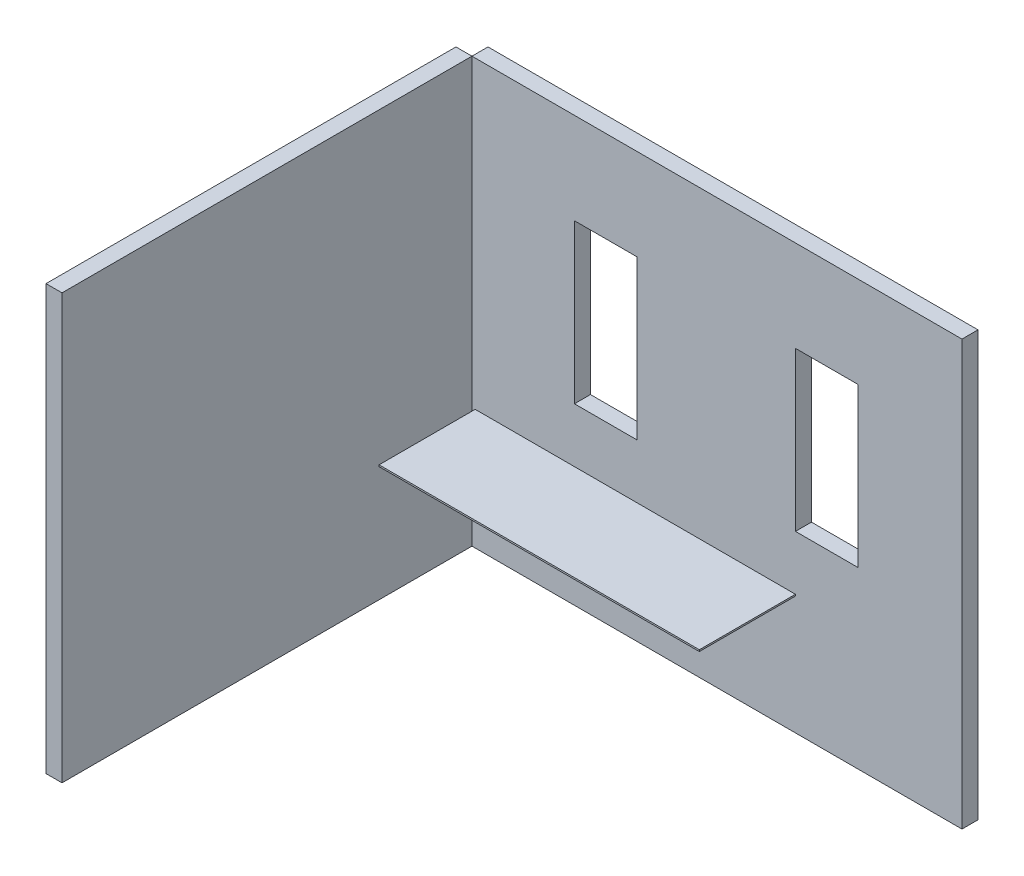
ISO-10303-21;
HEADER;
FILE_DESCRIPTION(('STEP AP214'),'2;1');
FILE_NAME('part.step','',(''),(''),'','','');
FILE_SCHEMA(('AUTOMOTIVE_DESIGN { 1 0 10303 214 1 1 1 1 }'));
ENDSEC;
DATA;
#1=APPLICATION_CONTEXT('core data for automotive mechanical design processes');
#2=APPLICATION_PROTOCOL_DEFINITION('international standard','automotive_design',2000,#1);
#3=PRODUCT_CONTEXT('',#1,'mechanical');
#4=PRODUCT('Part','Part','',(#3));
#5=PRODUCT_RELATED_PRODUCT_CATEGORY('part','',(#4));
#6=PRODUCT_DEFINITION_FORMATION('','',#4);
#7=PRODUCT_DEFINITION_CONTEXT('part definition',#1,'design');
#8=PRODUCT_DEFINITION('design','',#6,#7);
#9=PRODUCT_DEFINITION_SHAPE('','',#8);
#10=(LENGTH_UNIT() NAMED_UNIT(*) SI_UNIT(.MILLI.,.METRE.));
#11=(NAMED_UNIT(*) PLANE_ANGLE_UNIT() SI_UNIT($,.RADIAN.));
#12=(NAMED_UNIT(*) SI_UNIT($,.STERADIAN.) SOLID_ANGLE_UNIT());
#13=UNCERTAINTY_MEASURE_WITH_UNIT(LENGTH_MEASURE(1.E-05),#10,'distance_accuracy_value','');
#14=(GEOMETRIC_REPRESENTATION_CONTEXT(3) GLOBAL_UNCERTAINTY_ASSIGNED_CONTEXT((#13)) GLOBAL_UNIT_ASSIGNED_CONTEXT((#10,
#11,#12)) REPRESENTATION_CONTEXT('',''));
#15=CARTESIAN_POINT('',(0.,0.,0.));
#16=DIRECTION('',(0.,0.,1.));
#17=DIRECTION('',(1.,0.,0.));
#18=AXIS2_PLACEMENT_3D('',#15,#16,#17);
#19=CARTESIAN_POINT('',(0.,2650.,2660.));
#20=DIRECTION('',(-1.,0.,0.));
#21=DIRECTION('',(0.,0.,1.));
#22=AXIS2_PLACEMENT_3D('',#19,#20,#21);
#23=PLANE('',#22);
#24=DIRECTION('',(0.,1.,0.));
#25=VECTOR('',#24,1.);
#26=CARTESIAN_POINT('',(0.,2650.,100.));
#27=LINE('',#26,#25);
#28=CARTESIAN_POINT('',(0.,0.,100.));
#29=VERTEX_POINT('',#28);
#30=CARTESIAN_POINT('',(0.,2650.,100.));
#31=VERTEX_POINT('',#30);
#32=EDGE_CURVE('E108',#29,#31,#27,.T.);
#33=ORIENTED_EDGE('',*,*,#32,.T.);
#34=DIRECTION('',(0.,0.,-1.));
#35=VECTOR('',#34,1.);
#36=CARTESIAN_POINT('',(0.,2650.,2660.));
#37=LINE('',#36,#35);
#38=CARTESIAN_POINT('',(0.,2650.,2660.));
#39=VERTEX_POINT('',#38);
#40=EDGE_CURVE('E12',#39,#31,#37,.T.);
#41=ORIENTED_EDGE('',*,*,#40,.F.);
#42=DIRECTION('',(0.,1.,0.));
#43=VECTOR('',#42,1.);
#44=CARTESIAN_POINT('',(0.,2650.,2660.));
#45=LINE('',#44,#43);
#46=CARTESIAN_POINT('',(0.,0.,2660.));
#47=VERTEX_POINT('',#46);
#48=EDGE_CURVE('E96',#47,#39,#45,.T.);
#49=ORIENTED_EDGE('',*,*,#48,.F.);
#50=DIRECTION('',(0.,0.,-1.));
#51=VECTOR('',#50,1.);
#52=CARTESIAN_POINT('',(0.,0.,2660.));
#53=LINE('',#52,#51);
#54=EDGE_CURVE('E104',#47,#29,#53,.T.);
#55=ORIENTED_EDGE('',*,*,#54,.T.);
#56=EDGE_LOOP('',(#33,#41,#49,#55));
#57=FACE_BOUND('',#56,.T.);
#58=ADVANCED_FACE('F45',(#57),#23,.F.);
#59=CARTESIAN_POINT('',(0.,2650.,2660.));
#60=DIRECTION('',(0.,-1.,0.));
#61=DIRECTION('',(0.,0.,-1.));
#62=AXIS2_PLACEMENT_3D('',#59,#60,#61);
#63=PLANE('',#62);
#64=DIRECTION('',(-1.,0.,0.));
#65=VECTOR('',#64,1.);
#66=CARTESIAN_POINT('',(0.,2650.,100.));
#67=LINE('',#66,#65);
#68=CARTESIAN_POINT('',(-100.,2650.,100.));
#69=VERTEX_POINT('',#68);
#70=EDGE_CURVE('E100',#31,#69,#67,.T.);
#71=ORIENTED_EDGE('',*,*,#70,.T.);
#72=DIRECTION('',(0.,0.,-1.));
#73=VECTOR('',#72,1.);
#74=CARTESIAN_POINT('',(-100.,2650.,2660.));
#75=LINE('',#74,#73);
#76=CARTESIAN_POINT('',(-100.,2650.,2660.));
#77=VERTEX_POINT('',#76);
#78=EDGE_CURVE('E53',#77,#69,#75,.T.);
#79=ORIENTED_EDGE('',*,*,#78,.F.);
#80=DIRECTION('',(-1.,0.,0.));
#81=VECTOR('',#80,1.);
#82=CARTESIAN_POINT('',(0.,2650.,2660.));
#83=LINE('',#82,#81);
#84=EDGE_CURVE('E91',#39,#77,#83,.T.);
#85=ORIENTED_EDGE('',*,*,#84,.F.);
#86=ORIENTED_EDGE('',*,*,#40,.T.);
#87=EDGE_LOOP('',(#71,#79,#85,#86));
#88=FACE_BOUND('',#87,.T.);
#89=ADVANCED_FACE('F99',(#88),#63,.F.);
#90=CARTESIAN_POINT('',(-100.,2650.,2660.));
#91=DIRECTION('',(1.,0.,0.));
#92=DIRECTION('',(0.,1.,0.));
#93=AXIS2_PLACEMENT_3D('',#90,#91,#92);
#94=PLANE('',#93);
#95=DIRECTION('',(0.,-1.,0.));
#96=VECTOR('',#95,1.);
#97=CARTESIAN_POINT('',(-100.,2650.,100.));
#98=LINE('',#97,#96);
#99=CARTESIAN_POINT('',(-99.9999999999997,0.,100.));
#100=VERTEX_POINT('',#99);
#101=EDGE_CURVE('E78',#69,#100,#98,.T.);
#102=ORIENTED_EDGE('',*,*,#101,.T.);
#103=DIRECTION('',(0.,0.,-1.));
#104=VECTOR('',#103,1.);
#105=CARTESIAN_POINT('',(-99.9999999999997,0.,2660.));
#106=LINE('',#105,#104);
#107=CARTESIAN_POINT('',(-99.9999999999997,0.,2660.));
#108=VERTEX_POINT('',#107);
#109=EDGE_CURVE('E101',#108,#100,#106,.T.);
#110=ORIENTED_EDGE('',*,*,#109,.F.);
#111=DIRECTION('',(0.,-1.,0.));
#112=VECTOR('',#111,1.);
#113=CARTESIAN_POINT('',(-100.,2650.,2660.));
#114=LINE('',#113,#112);
#115=EDGE_CURVE('E94',#77,#108,#114,.T.);
#116=ORIENTED_EDGE('',*,*,#115,.F.);
#117=ORIENTED_EDGE('',*,*,#78,.T.);
#118=EDGE_LOOP('',(#102,#110,#116,#117));
#119=FACE_BOUND('',#118,.T.);
#120=ADVANCED_FACE('F102',(#119),#94,.F.);
#121=CARTESIAN_POINT('',(0.,0.,2660.));
#122=DIRECTION('',(0.,1.,0.));
#123=DIRECTION('',(-1.,0.,0.));
#124=AXIS2_PLACEMENT_3D('',#121,#122,#123);
#125=PLANE('',#124);
#126=DIRECTION('',(1.,0.,0.));
#127=VECTOR('',#126,1.);
#128=CARTESIAN_POINT('',(0.,0.,100.));
#129=LINE('',#128,#127);
#130=EDGE_CURVE('E84',#100,#29,#129,.T.);
#131=ORIENTED_EDGE('',*,*,#130,.T.);
#132=ORIENTED_EDGE('',*,*,#54,.F.);
#133=DIRECTION('',(1.,0.,0.));
#134=VECTOR('',#133,1.);
#135=CARTESIAN_POINT('',(0.,0.,2660.));
#136=LINE('',#135,#134);
#137=EDGE_CURVE('E61',#108,#47,#136,.T.);
#138=ORIENTED_EDGE('',*,*,#137,.F.);
#139=ORIENTED_EDGE('',*,*,#109,.T.);
#140=EDGE_LOOP('',(#131,#132,#138,#139));
#141=FACE_BOUND('',#140,.T.);
#142=ADVANCED_FACE('F115',(#141),#125,.F.);
#143=CARTESIAN_POINT('',(0.,0.,2660.));
#144=DIRECTION('',(0.,0.,-1.));
#145=DIRECTION('',(-1.,0.,0.));
#146=AXIS2_PLACEMENT_3D('',#143,#144,#145);
#147=PLANE('',#146);
#148=ORIENTED_EDGE('',*,*,#48,.T.);
#149=ORIENTED_EDGE('',*,*,#84,.T.);
#150=ORIENTED_EDGE('',*,*,#115,.T.);
#151=ORIENTED_EDGE('',*,*,#137,.T.);
#152=EDGE_LOOP('',(#148,#149,#150,#151));
#153=FACE_BOUND('',#152,.T.);
#154=ADVANCED_FACE('F92',(#153),#147,.F.);
#155=CARTESIAN_POINT('',(0.,0.,100.));
#156=DIRECTION('',(0.,0.,-1.));
#157=DIRECTION('',(-1.,0.,0.));
#158=AXIS2_PLACEMENT_3D('',#155,#156,#157);
#159=PLANE('',#158);
#160=ORIENTED_EDGE('',*,*,#32,.F.);
#161=ORIENTED_EDGE('',*,*,#130,.F.);
#162=ORIENTED_EDGE('',*,*,#101,.F.);
#163=ORIENTED_EDGE('',*,*,#70,.F.);
#164=EDGE_LOOP('',(#160,#161,#162,#163));
#165=FACE_BOUND('',#164,.T.);
#166=ADVANCED_FACE('F118',(#165),#159,.T.);
#167=CLOSED_SHELL('',(#58,#89,#120,#142,#154,#166));
#168=MANIFOLD_SOLID_BREP('B2',#167);
#169=CARTESIAN_POINT('',(0.,0.,100.));
#170=DIRECTION('',(1.,0.,0.));
#171=DIRECTION('',(0.,0.,-1.));
#172=AXIS2_PLACEMENT_3D('',#169,#170,#171);
#173=PLANE('',#172);
#174=DIRECTION('',(0.,-1.,0.));
#175=VECTOR('',#174,1.);
#176=CARTESIAN_POINT('',(0.,0.,0.));
#177=LINE('',#176,#175);
#178=CARTESIAN_POINT('',(0.,2650.,0.));
#179=VERTEX_POINT('',#178);
#180=CARTESIAN_POINT('',(0.,0.,0.));
#181=VERTEX_POINT('',#180);
#182=EDGE_CURVE('E353',#179,#181,#177,.T.);
#183=ORIENTED_EDGE('',*,*,#182,.T.);
#184=DIRECTION('',(0.,0.,-1.));
#185=VECTOR('',#184,1.);
#186=CARTESIAN_POINT('',(0.,0.,100.));
#187=LINE('',#186,#185);
#188=CARTESIAN_POINT('',(0.,0.,100.));
#189=VERTEX_POINT('',#188);
#190=EDGE_CURVE('E386',#189,#181,#187,.T.);
#191=ORIENTED_EDGE('',*,*,#190,.F.);
#192=DIRECTION('',(0.,-1.,0.));
#193=VECTOR('',#192,1.);
#194=CARTESIAN_POINT('',(0.,0.,100.));
#195=LINE('',#194,#193);
#196=CARTESIAN_POINT('',(0.,2650.,100.));
#197=VERTEX_POINT('',#196);
#198=EDGE_CURVE('E360',#197,#189,#195,.T.);
#199=ORIENTED_EDGE('',*,*,#198,.F.);
#200=DIRECTION('',(0.,0.,-1.));
#201=VECTOR('',#200,1.);
#202=CARTESIAN_POINT('',(0.,2650.,100.));
#203=LINE('',#202,#201);
#204=EDGE_CURVE('E370',#197,#179,#203,.T.);
#205=ORIENTED_EDGE('',*,*,#204,.T.);
#206=EDGE_LOOP('',(#183,#191,#199,#205));
#207=FACE_BOUND('',#206,.T.);
#208=ADVANCED_FACE('F169',(#207),#173,.F.);
#209=CARTESIAN_POINT('',(0.,0.,100.));
#210=DIRECTION('',(0.,1.,0.));
#211=DIRECTION('',(0.,0.,1.));
#212=AXIS2_PLACEMENT_3D('',#209,#210,#211);
#213=PLANE('',#212);
#214=DIRECTION('',(1.,0.,0.));
#215=VECTOR('',#214,1.);
#216=CARTESIAN_POINT('',(0.,0.,0.));
#217=LINE('',#216,#215);
#218=CARTESIAN_POINT('',(3060.,0.,0.));
#219=VERTEX_POINT('',#218);
#220=EDGE_CURVE('E373',#181,#219,#217,.T.);
#221=ORIENTED_EDGE('',*,*,#220,.T.);
#222=DIRECTION('',(0.,0.,-1.));
#223=VECTOR('',#222,1.);
#224=CARTESIAN_POINT('',(3060.,0.,100.));
#225=LINE('',#224,#223);
#226=CARTESIAN_POINT('',(3060.,0.,100.));
#227=VERTEX_POINT('',#226);
#228=EDGE_CURVE('E383',#227,#219,#225,.T.);
#229=ORIENTED_EDGE('',*,*,#228,.F.);
#230=DIRECTION('',(1.,0.,0.));
#231=VECTOR('',#230,1.);
#232=CARTESIAN_POINT('',(0.,0.,100.));
#233=LINE('',#232,#231);
#234=EDGE_CURVE('E363',#189,#227,#233,.T.);
#235=ORIENTED_EDGE('',*,*,#234,.F.);
#236=ORIENTED_EDGE('',*,*,#190,.T.);
#237=EDGE_LOOP('',(#221,#229,#235,#236));
#238=FACE_BOUND('',#237,.T.);
#239=ADVANCED_FACE('F440',(#238),#213,.F.);
#240=CARTESIAN_POINT('',(3060.,0.,100.));
#241=DIRECTION('',(-1.,0.,0.));
#242=DIRECTION('',(0.,0.,1.));
#243=AXIS2_PLACEMENT_3D('',#240,#241,#242);
#244=PLANE('',#243);
#245=DIRECTION('',(0.,1.,0.));
#246=VECTOR('',#245,1.);
#247=CARTESIAN_POINT('',(3060.,0.,0.));
#248=LINE('',#247,#246);
#249=CARTESIAN_POINT('',(3060.,2650.,0.));
#250=VERTEX_POINT('',#249);
#251=EDGE_CURVE('E375',#219,#250,#248,.T.);
#252=ORIENTED_EDGE('',*,*,#251,.T.);
#253=DIRECTION('',(0.,0.,-1.));
#254=VECTOR('',#253,1.);
#255=CARTESIAN_POINT('',(3060.,2650.,100.));
#256=LINE('',#255,#254);
#257=CARTESIAN_POINT('',(3060.,2650.,100.));
#258=VERTEX_POINT('',#257);
#259=EDGE_CURVE('E380',#258,#250,#256,.T.);
#260=ORIENTED_EDGE('',*,*,#259,.F.);
#261=DIRECTION('',(0.,1.,0.));
#262=VECTOR('',#261,1.);
#263=CARTESIAN_POINT('',(3060.,0.,100.));
#264=LINE('',#263,#262);
#265=EDGE_CURVE('E366',#227,#258,#264,.T.);
#266=ORIENTED_EDGE('',*,*,#265,.F.);
#267=ORIENTED_EDGE('',*,*,#228,.T.);
#268=EDGE_LOOP('',(#252,#260,#266,#267));
#269=FACE_BOUND('',#268,.T.);
#270=ADVANCED_FACE('F445',(#269),#244,.F.);
#271=CARTESIAN_POINT('',(0.,2650.,100.));
#272=DIRECTION('',(0.,-1.,0.));
#273=DIRECTION('',(0.,0.,-1.));
#274=AXIS2_PLACEMENT_3D('',#271,#272,#273);
#275=PLANE('',#274);
#276=DIRECTION('',(-1.,0.,0.));
#277=VECTOR('',#276,1.);
#278=CARTESIAN_POINT('',(0.,2650.,0.));
#279=LINE('',#278,#277);
#280=EDGE_CURVE('E364',#250,#179,#279,.T.);
#281=ORIENTED_EDGE('',*,*,#280,.T.);
#282=ORIENTED_EDGE('',*,*,#204,.F.);
#283=DIRECTION('',(-1.,0.,0.));
#284=VECTOR('',#283,1.);
#285=CARTESIAN_POINT('',(0.,2650.,100.));
#286=LINE('',#285,#284);
#287=EDGE_CURVE('E368',#258,#197,#286,.T.);
#288=ORIENTED_EDGE('',*,*,#287,.F.);
#289=ORIENTED_EDGE('',*,*,#259,.T.);
#290=EDGE_LOOP('',(#281,#282,#288,#289));
#291=FACE_BOUND('',#290,.T.);
#292=ADVANCED_FACE('F425',(#291),#275,.F.);
#293=CARTESIAN_POINT('',(0.,0.,100.));
#294=DIRECTION('',(0.,0.,-1.));
#295=DIRECTION('',(-1.,0.,0.));
#296=AXIS2_PLACEMENT_3D('',#293,#294,#295);
#297=PLANE('',#296);
#298=DIRECTION('',(-1.,0.,0.));
#299=VECTOR('',#298,1.);
#300=CARTESIAN_POINT('',(2020.,740.,100.));
#301=LINE('',#300,#299);
#302=CARTESIAN_POINT('',(2020.,740.,100.));
#303=VERTEX_POINT('',#302);
#304=CARTESIAN_POINT('',(20.0000000000005,740.,100.));
#305=VERTEX_POINT('',#304);
#306=EDGE_CURVE('E306',#303,#305,#301,.T.);
#307=ORIENTED_EDGE('',*,*,#306,.T.);
#308=DIRECTION('',(0.,1.,0.));
#309=VECTOR('',#308,1.);
#310=CARTESIAN_POINT('',(20.0000000000005,740.,100.));
#311=LINE('',#310,#309);
#312=CARTESIAN_POINT('',(20.0000000000004,750.,100.));
#313=VERTEX_POINT('',#312);
#314=EDGE_CURVE('E313',#305,#313,#311,.T.);
#315=ORIENTED_EDGE('',*,*,#314,.T.);
#316=DIRECTION('',(1.,0.,0.));
#317=VECTOR('',#316,1.);
#318=CARTESIAN_POINT('',(20.0000000000004,750.,100.));
#319=LINE('',#318,#317);
#320=CARTESIAN_POINT('',(2020.,750.,100.));
#321=VERTEX_POINT('',#320);
#322=EDGE_CURVE('E286',#313,#321,#319,.T.);
#323=ORIENTED_EDGE('',*,*,#322,.T.);
#324=DIRECTION('',(0.,-1.,0.));
#325=VECTOR('',#324,1.);
#326=CARTESIAN_POINT('',(2020.,750.,100.));
#327=LINE('',#326,#325);
#328=EDGE_CURVE('E183',#321,#303,#327,.T.);
#329=ORIENTED_EDGE('',*,*,#328,.T.);
#330=EDGE_LOOP('',(#307,#315,#323,#329));
#331=FACE_BOUND('',#330,.T.);
#332=DIRECTION('',(0.,-1.,0.));
#333=VECTOR('',#332,1.);
#334=CARTESIAN_POINT('',(640.,2080.,100.));
#335=LINE('',#334,#333);
#336=CARTESIAN_POINT('',(640.,2080.,100.));
#337=VERTEX_POINT('',#336);
#338=CARTESIAN_POINT('',(640.,1090.,100.));
#339=VERTEX_POINT('',#338);
#340=EDGE_CURVE('E322',#337,#339,#335,.T.);
#341=ORIENTED_EDGE('',*,*,#340,.F.);
#342=DIRECTION('',(-1.,0.,0.));
#343=VECTOR('',#342,1.);
#344=CARTESIAN_POINT('',(640.,2080.,100.));
#345=LINE('',#344,#343);
#346=CARTESIAN_POINT('',(1030.,2080.,100.));
#347=VERTEX_POINT('',#346);
#348=EDGE_CURVE('E191',#347,#337,#345,.T.);
#349=ORIENTED_EDGE('',*,*,#348,.F.);
#350=DIRECTION('',(0.,1.,0.));
#351=VECTOR('',#350,1.);
#352=CARTESIAN_POINT('',(1030.,2080.,100.));
#353=LINE('',#352,#351);
#354=CARTESIAN_POINT('',(1030.,1090.,100.));
#355=VERTEX_POINT('',#354);
#356=EDGE_CURVE('E328',#355,#347,#353,.T.);
#357=ORIENTED_EDGE('',*,*,#356,.F.);
#358=DIRECTION('',(1.,0.,0.));
#359=VECTOR('',#358,1.);
#360=CARTESIAN_POINT('',(1030.,1090.,100.));
#361=LINE('',#360,#359);
#362=EDGE_CURVE('E325',#339,#355,#361,.T.);
#363=ORIENTED_EDGE('',*,*,#362,.F.);
#364=EDGE_LOOP('',(#341,#349,#357,#363));
#365=FACE_BOUND('',#364,.T.);
#366=DIRECTION('',(0.,1.,0.));
#367=VECTOR('',#366,1.);
#368=CARTESIAN_POINT('',(2410.,1090.,100.));
#369=LINE('',#368,#367);
#370=CARTESIAN_POINT('',(2410.,1090.,100.));
#371=VERTEX_POINT('',#370);
#372=CARTESIAN_POINT('',(2410.,2080.,100.));
#373=VERTEX_POINT('',#372);
#374=EDGE_CURVE('E341',#371,#373,#369,.T.);
#375=ORIENTED_EDGE('',*,*,#374,.F.);
#376=DIRECTION('',(1.,0.,0.));
#377=VECTOR('',#376,1.);
#378=CARTESIAN_POINT('',(2020.,1090.,100.));
#379=LINE('',#378,#377);
#380=CARTESIAN_POINT('',(2020.,1090.,100.));
#381=VERTEX_POINT('',#380);
#382=EDGE_CURVE('E334',#381,#371,#379,.T.);
#383=ORIENTED_EDGE('',*,*,#382,.F.);
#384=DIRECTION('',(0.,-1.,0.));
#385=VECTOR('',#384,1.);
#386=CARTESIAN_POINT('',(2020.,2080.,100.));
#387=LINE('',#386,#385);
#388=CARTESIAN_POINT('',(2020.,2080.,100.));
#389=VERTEX_POINT('',#388);
#390=EDGE_CURVE('E347',#389,#381,#387,.T.);
#391=ORIENTED_EDGE('',*,*,#390,.F.);
#392=DIRECTION('',(-1.,0.,0.));
#393=VECTOR('',#392,1.);
#394=CARTESIAN_POINT('',(2410.,2080.,100.));
#395=LINE('',#394,#393);
#396=EDGE_CURVE('E344',#373,#389,#395,.T.);
#397=ORIENTED_EDGE('',*,*,#396,.F.);
#398=EDGE_LOOP('',(#375,#383,#391,#397));
#399=FACE_BOUND('',#398,.T.);
#400=ORIENTED_EDGE('',*,*,#198,.T.);
#401=ORIENTED_EDGE('',*,*,#234,.T.);
#402=ORIENTED_EDGE('',*,*,#265,.T.);
#403=ORIENTED_EDGE('',*,*,#287,.T.);
#404=EDGE_LOOP('',(#400,#401,#402,#403));
#405=FACE_BOUND('',#404,.T.);
#406=ADVANCED_FACE('F422',(#331,#365,#399,#405),#297,.F.);
#407=CARTESIAN_POINT('',(0.,0.,0.));
#408=DIRECTION('',(0.,0.,-1.));
#409=DIRECTION('',(-1.,0.,0.));
#410=AXIS2_PLACEMENT_3D('',#407,#408,#409);
#411=PLANE('',#410);
#412=DIRECTION('',(1.,0.,0.));
#413=VECTOR('',#412,1.);
#414=CARTESIAN_POINT('',(0.,2080.,0.));
#415=LINE('',#414,#413);
#416=CARTESIAN_POINT('',(640.,2080.,0.));
#417=VERTEX_POINT('',#416);
#418=CARTESIAN_POINT('',(1030.,2080.,0.));
#419=VERTEX_POINT('',#418);
#420=EDGE_CURVE('E43',#417,#419,#415,.T.);
#421=ORIENTED_EDGE('',*,*,#420,.F.);
#422=DIRECTION('',(0.,1.,0.));
#423=VECTOR('',#422,1.);
#424=CARTESIAN_POINT('',(640.,0.,0.));
#425=LINE('',#424,#423);
#426=CARTESIAN_POINT('',(640.,1090.,0.));
#427=VERTEX_POINT('',#426);
#428=EDGE_CURVE('E398',#427,#417,#425,.T.);
#429=ORIENTED_EDGE('',*,*,#428,.F.);
#430=DIRECTION('',(-1.,0.,0.));
#431=VECTOR('',#430,1.);
#432=CARTESIAN_POINT('',(0.,1090.,0.));
#433=LINE('',#432,#431);
#434=CARTESIAN_POINT('',(1030.,1090.,0.));
#435=VERTEX_POINT('',#434);
#436=EDGE_CURVE('E400',#435,#427,#433,.T.);
#437=ORIENTED_EDGE('',*,*,#436,.F.);
#438=DIRECTION('',(0.,-1.,0.));
#439=VECTOR('',#438,1.);
#440=CARTESIAN_POINT('',(1030.,0.,0.));
#441=LINE('',#440,#439);
#442=EDGE_CURVE('E176',#419,#435,#441,.T.);
#443=ORIENTED_EDGE('',*,*,#442,.F.);
#444=EDGE_LOOP('',(#421,#429,#437,#443));
#445=FACE_BOUND('',#444,.T.);
#446=DIRECTION('',(-1.,0.,0.));
#447=VECTOR('',#446,1.);
#448=CARTESIAN_POINT('',(0.,1090.,0.));
#449=LINE('',#448,#447);
#450=CARTESIAN_POINT('',(2410.,1090.,0.));
#451=VERTEX_POINT('',#450);
#452=CARTESIAN_POINT('',(2020.,1090.,0.));
#453=VERTEX_POINT('',#452);
#454=EDGE_CURVE('E396',#451,#453,#449,.T.);
#455=ORIENTED_EDGE('',*,*,#454,.F.);
#456=DIRECTION('',(0.,-1.,0.));
#457=VECTOR('',#456,1.);
#458=CARTESIAN_POINT('',(2410.,0.,0.));
#459=LINE('',#458,#457);
#460=CARTESIAN_POINT('',(2410.,2080.,0.));
#461=VERTEX_POINT('',#460);
#462=EDGE_CURVE('E389',#461,#451,#459,.T.);
#463=ORIENTED_EDGE('',*,*,#462,.F.);
#464=DIRECTION('',(1.,0.,0.));
#465=VECTOR('',#464,1.);
#466=CARTESIAN_POINT('',(0.,2080.,0.));
#467=LINE('',#466,#465);
#468=CARTESIAN_POINT('',(2020.,2080.,0.));
#469=VERTEX_POINT('',#468);
#470=EDGE_CURVE('E391',#469,#461,#467,.T.);
#471=ORIENTED_EDGE('',*,*,#470,.F.);
#472=DIRECTION('',(0.,1.,0.));
#473=VECTOR('',#472,1.);
#474=CARTESIAN_POINT('',(2020.,0.,0.));
#475=LINE('',#474,#473);
#476=EDGE_CURVE('E394',#453,#469,#475,.T.);
#477=ORIENTED_EDGE('',*,*,#476,.F.);
#478=EDGE_LOOP('',(#455,#463,#471,#477));
#479=FACE_BOUND('',#478,.T.);
#480=ORIENTED_EDGE('',*,*,#182,.F.);
#481=ORIENTED_EDGE('',*,*,#280,.F.);
#482=ORIENTED_EDGE('',*,*,#251,.F.);
#483=ORIENTED_EDGE('',*,*,#220,.F.);
#484=EDGE_LOOP('',(#480,#481,#482,#483));
#485=FACE_BOUND('',#484,.T.);
#486=ADVANCED_FACE('F415',(#445,#479,#485),#411,.T.);
#487=CARTESIAN_POINT('',(2020.,1090.,-649.));
#488=DIRECTION('',(0.,-1.,0.));
#489=DIRECTION('',(0.,0.,-1.));
#490=AXIS2_PLACEMENT_3D('',#487,#488,#489);
#491=PLANE('',#490);
#492=ORIENTED_EDGE('',*,*,#454,.T.);
#493=DIRECTION('',(0.,0.,1.));
#494=VECTOR('',#493,1.);
#495=CARTESIAN_POINT('',(2020.,1090.,-649.));
#496=LINE('',#495,#494);
#497=EDGE_CURVE('E351',#453,#381,#496,.T.);
#498=ORIENTED_EDGE('',*,*,#497,.T.);
#499=ORIENTED_EDGE('',*,*,#382,.T.);
#500=DIRECTION('',(0.,0.,1.));
#501=VECTOR('',#500,1.);
#502=CARTESIAN_POINT('',(2410.,1090.,-649.));
#503=LINE('',#502,#501);
#504=EDGE_CURVE('E350',#451,#371,#503,.T.);
#505=ORIENTED_EDGE('',*,*,#504,.F.);
#506=EDGE_LOOP('',(#492,#498,#499,#505));
#507=FACE_BOUND('',#506,.T.);
#508=ADVANCED_FACE('F450',(#507),#491,.F.);
#509=CARTESIAN_POINT('',(2020.,2080.,-649.));
#510=DIRECTION('',(-1.,0.,0.));
#511=DIRECTION('',(0.,0.,1.));
#512=AXIS2_PLACEMENT_3D('',#509,#510,#511);
#513=PLANE('',#512);
#514=ORIENTED_EDGE('',*,*,#476,.T.);
#515=DIRECTION('',(0.,0.,1.));
#516=VECTOR('',#515,1.);
#517=CARTESIAN_POINT('',(2020.,2080.,-649.));
#518=LINE('',#517,#516);
#519=EDGE_CURVE('E354',#469,#389,#518,.T.);
#520=ORIENTED_EDGE('',*,*,#519,.T.);
#521=ORIENTED_EDGE('',*,*,#390,.T.);
#522=ORIENTED_EDGE('',*,*,#497,.F.);
#523=EDGE_LOOP('',(#514,#520,#521,#522));
#524=FACE_BOUND('',#523,.T.);
#525=ADVANCED_FACE('F456',(#524),#513,.F.);
#526=CARTESIAN_POINT('',(2410.,2080.,-649.));
#527=DIRECTION('',(0.,1.,0.));
#528=DIRECTION('',(0.,0.,1.));
#529=AXIS2_PLACEMENT_3D('',#526,#527,#528);
#530=PLANE('',#529);
#531=ORIENTED_EDGE('',*,*,#470,.T.);
#532=DIRECTION('',(0.,0.,1.));
#533=VECTOR('',#532,1.);
#534=CARTESIAN_POINT('',(2410.,2080.,-649.));
#535=LINE('',#534,#533);
#536=EDGE_CURVE('E356',#461,#373,#535,.T.);
#537=ORIENTED_EDGE('',*,*,#536,.T.);
#538=ORIENTED_EDGE('',*,*,#396,.T.);
#539=ORIENTED_EDGE('',*,*,#519,.F.);
#540=EDGE_LOOP('',(#531,#537,#538,#539));
#541=FACE_BOUND('',#540,.T.);
#542=ADVANCED_FACE('F542',(#541),#530,.F.);
#543=CARTESIAN_POINT('',(2410.,1090.,-649.));
#544=DIRECTION('',(1.,0.,0.));
#545=DIRECTION('',(0.,0.,-1.));
#546=AXIS2_PLACEMENT_3D('',#543,#544,#545);
#547=PLANE('',#546);
#548=ORIENTED_EDGE('',*,*,#462,.T.);
#549=ORIENTED_EDGE('',*,*,#504,.T.);
#550=ORIENTED_EDGE('',*,*,#374,.T.);
#551=ORIENTED_EDGE('',*,*,#536,.F.);
#552=EDGE_LOOP('',(#548,#549,#550,#551));
#553=FACE_BOUND('',#552,.T.);
#554=ADVANCED_FACE('F539',(#553),#547,.F.);
#555=CARTESIAN_POINT('',(640.,2080.,-649.));
#556=DIRECTION('',(0.,1.,0.));
#557=DIRECTION('',(0.,0.,1.));
#558=AXIS2_PLACEMENT_3D('',#555,#556,#557);
#559=PLANE('',#558);
#560=ORIENTED_EDGE('',*,*,#420,.T.);
#561=DIRECTION('',(0.,0.,1.));
#562=VECTOR('',#561,1.);
#563=CARTESIAN_POINT('',(1030.,2080.,-649.));
#564=LINE('',#563,#562);
#565=EDGE_CURVE('E332',#419,#347,#564,.T.);
#566=ORIENTED_EDGE('',*,*,#565,.T.);
#567=ORIENTED_EDGE('',*,*,#348,.T.);
#568=DIRECTION('',(0.,0.,1.));
#569=VECTOR('',#568,1.);
#570=CARTESIAN_POINT('',(640.,2080.,-649.));
#571=LINE('',#570,#569);
#572=EDGE_CURVE('E331',#417,#337,#571,.T.);
#573=ORIENTED_EDGE('',*,*,#572,.F.);
#574=EDGE_LOOP('',(#560,#566,#567,#573));
#575=FACE_BOUND('',#574,.T.);
#576=ADVANCED_FACE('F420',(#575),#559,.F.);
#577=CARTESIAN_POINT('',(1030.,2080.,-649.));
#578=DIRECTION('',(1.,0.,0.));
#579=DIRECTION('',(0.,0.,-1.));
#580=AXIS2_PLACEMENT_3D('',#577,#578,#579);
#581=PLANE('',#580);
#582=ORIENTED_EDGE('',*,*,#442,.T.);
#583=DIRECTION('',(0.,0.,1.));
#584=VECTOR('',#583,1.);
#585=CARTESIAN_POINT('',(1030.,1090.,-649.));
#586=LINE('',#585,#584);
#587=EDGE_CURVE('E335',#435,#355,#586,.T.);
#588=ORIENTED_EDGE('',*,*,#587,.T.);
#589=ORIENTED_EDGE('',*,*,#356,.T.);
#590=ORIENTED_EDGE('',*,*,#565,.F.);
#591=EDGE_LOOP('',(#582,#588,#589,#590));
#592=FACE_BOUND('',#591,.T.);
#593=ADVANCED_FACE('F406',(#592),#581,.F.);
#594=CARTESIAN_POINT('',(1030.,1090.,-649.));
#595=DIRECTION('',(0.,-1.,0.));
#596=DIRECTION('',(0.,0.,-1.));
#597=AXIS2_PLACEMENT_3D('',#594,#595,#596);
#598=PLANE('',#597);
#599=ORIENTED_EDGE('',*,*,#436,.T.);
#600=DIRECTION('',(0.,0.,1.));
#601=VECTOR('',#600,1.);
#602=CARTESIAN_POINT('',(640.,1090.,-649.));
#603=LINE('',#602,#601);
#604=EDGE_CURVE('E337',#427,#339,#603,.T.);
#605=ORIENTED_EDGE('',*,*,#604,.T.);
#606=ORIENTED_EDGE('',*,*,#362,.T.);
#607=ORIENTED_EDGE('',*,*,#587,.F.);
#608=EDGE_LOOP('',(#599,#605,#606,#607));
#609=FACE_BOUND('',#608,.T.);
#610=ADVANCED_FACE('F411',(#609),#598,.F.);
#611=CARTESIAN_POINT('',(640.,2080.,-649.));
#612=DIRECTION('',(-1.,0.,0.));
#613=DIRECTION('',(0.,-1.,0.));
#614=AXIS2_PLACEMENT_3D('',#611,#612,#613);
#615=PLANE('',#614);
#616=ORIENTED_EDGE('',*,*,#428,.T.);
#617=ORIENTED_EDGE('',*,*,#572,.T.);
#618=ORIENTED_EDGE('',*,*,#340,.T.);
#619=ORIENTED_EDGE('',*,*,#604,.F.);
#620=EDGE_LOOP('',(#616,#617,#618,#619));
#621=FACE_BOUND('',#620,.T.);
#622=ADVANCED_FACE('F418',(#621),#615,.F.);
#623=CARTESIAN_POINT('',(20.0000000000005,740.,700.));
#624=DIRECTION('',(-1.,0.,0.));
#625=DIRECTION('',(0.,-1.,0.));
#626=AXIS2_PLACEMENT_3D('',#623,#624,#625);
#627=PLANE('',#626);
#628=ORIENTED_EDGE('',*,*,#314,.F.);
#629=DIRECTION('',(0.,0.,-1.));
#630=VECTOR('',#629,1.);
#631=CARTESIAN_POINT('',(20.0000000000005,740.,700.));
#632=LINE('',#631,#630);
#633=CARTESIAN_POINT('',(20.0000000000005,740.,700.));
#634=VERTEX_POINT('',#633);
#635=EDGE_CURVE('E305',#634,#305,#632,.T.);
#636=ORIENTED_EDGE('',*,*,#635,.F.);
#637=DIRECTION('',(0.,1.,0.));
#638=VECTOR('',#637,1.);
#639=CARTESIAN_POINT('',(20.0000000000005,740.,700.));
#640=LINE('',#639,#638);
#641=CARTESIAN_POINT('',(20.0000000000004,750.,700.));
#642=VERTEX_POINT('',#641);
#643=EDGE_CURVE('E299',#634,#642,#640,.T.);
#644=ORIENTED_EDGE('',*,*,#643,.T.);
#645=DIRECTION('',(0.,0.,-1.));
#646=VECTOR('',#645,1.);
#647=CARTESIAN_POINT('',(20.0000000000004,750.,700.));
#648=LINE('',#647,#646);
#649=EDGE_CURVE('E281',#642,#313,#648,.T.);
#650=ORIENTED_EDGE('',*,*,#649,.T.);
#651=EDGE_LOOP('',(#628,#636,#644,#650));
#652=FACE_BOUND('',#651,.T.);
#653=ADVANCED_FACE('F304',(#652),#627,.T.);
#654=CARTESIAN_POINT('',(2020.,740.,700.));
#655=DIRECTION('',(0.,-1.,0.));
#656=DIRECTION('',(1.,0.,0.));
#657=AXIS2_PLACEMENT_3D('',#654,#655,#656);
#658=PLANE('',#657);
#659=ORIENTED_EDGE('',*,*,#306,.F.);
#660=DIRECTION('',(0.,0.,-1.));
#661=VECTOR('',#660,1.);
#662=CARTESIAN_POINT('',(2020.,740.,700.));
#663=LINE('',#662,#661);
#664=CARTESIAN_POINT('',(2020.,740.,700.));
#665=VERTEX_POINT('',#664);
#666=EDGE_CURVE('E318',#665,#303,#663,.T.);
#667=ORIENTED_EDGE('',*,*,#666,.F.);
#668=DIRECTION('',(-1.,0.,0.));
#669=VECTOR('',#668,1.);
#670=CARTESIAN_POINT('',(2020.,740.,700.));
#671=LINE('',#670,#669);
#672=EDGE_CURVE('E292',#665,#634,#671,.T.);
#673=ORIENTED_EDGE('',*,*,#672,.T.);
#674=ORIENTED_EDGE('',*,*,#635,.T.);
#675=EDGE_LOOP('',(#659,#667,#673,#674));
#676=FACE_BOUND('',#675,.T.);
#677=ADVANCED_FACE('F491',(#676),#658,.T.);
#678=CARTESIAN_POINT('',(2020.,750.,700.));
#679=DIRECTION('',(1.,0.,0.));
#680=DIRECTION('',(0.,0.,-1.));
#681=AXIS2_PLACEMENT_3D('',#678,#679,#680);
#682=PLANE('',#681);
#683=ORIENTED_EDGE('',*,*,#328,.F.);
#684=DIRECTION('',(0.,0.,-1.));
#685=VECTOR('',#684,1.);
#686=CARTESIAN_POINT('',(2020.,750.,700.));
#687=LINE('',#686,#685);
#688=CARTESIAN_POINT('',(2020.,750.,700.));
#689=VERTEX_POINT('',#688);
#690=EDGE_CURVE('E291',#689,#321,#687,.T.);
#691=ORIENTED_EDGE('',*,*,#690,.F.);
#692=DIRECTION('',(0.,-1.,0.));
#693=VECTOR('',#692,1.);
#694=CARTESIAN_POINT('',(2020.,750.,700.));
#695=LINE('',#694,#693);
#696=EDGE_CURVE('E302',#689,#665,#695,.T.);
#697=ORIENTED_EDGE('',*,*,#696,.T.);
#698=ORIENTED_EDGE('',*,*,#666,.T.);
#699=EDGE_LOOP('',(#683,#691,#697,#698));
#700=FACE_BOUND('',#699,.T.);
#701=ADVANCED_FACE('F500',(#700),#682,.T.);
#702=CARTESIAN_POINT('',(20.0000000000004,750.,700.));
#703=DIRECTION('',(0.,1.,0.));
#704=DIRECTION('',(0.,0.,1.));
#705=AXIS2_PLACEMENT_3D('',#702,#703,#704);
#706=PLANE('',#705);
#707=ORIENTED_EDGE('',*,*,#322,.F.);
#708=ORIENTED_EDGE('',*,*,#649,.F.);
#709=DIRECTION('',(1.,0.,0.));
#710=VECTOR('',#709,1.);
#711=CARTESIAN_POINT('',(20.0000000000004,750.,700.));
#712=LINE('',#711,#710);
#713=EDGE_CURVE('E284',#642,#689,#712,.T.);
#714=ORIENTED_EDGE('',*,*,#713,.T.);
#715=ORIENTED_EDGE('',*,*,#690,.T.);
#716=EDGE_LOOP('',(#707,#708,#714,#715));
#717=FACE_BOUND('',#716,.T.);
#718=ADVANCED_FACE('F283',(#717),#706,.T.);
#719=CARTESIAN_POINT('',(0.,0.,700.));
#720=DIRECTION('',(0.,0.,-1.));
#721=DIRECTION('',(-1.,0.,0.));
#722=AXIS2_PLACEMENT_3D('',#719,#720,#721);
#723=PLANE('',#722);
#724=ORIENTED_EDGE('',*,*,#643,.F.);
#725=ORIENTED_EDGE('',*,*,#672,.F.);
#726=ORIENTED_EDGE('',*,*,#696,.F.);
#727=ORIENTED_EDGE('',*,*,#713,.F.);
#728=EDGE_LOOP('',(#724,#725,#726,#727));
#729=FACE_BOUND('',#728,.T.);
#730=ADVANCED_FACE('F297',(#729),#723,.F.);
#731=CLOSED_SHELL('',(#208,#239,#270,#292,#406,#486,#508,#525,#542,#554,#576,#593,#610,#622,
#653,#677,#701,#718,#730));
#732=MANIFOLD_SOLID_BREP('B6',#731);
#733=ADVANCED_BREP_SHAPE_REPRESENTATION('',(#18,#168,#732),#14);
#734=SHAPE_DEFINITION_REPRESENTATION(#9,#733);
ENDSEC;
END-ISO-10303-21;
